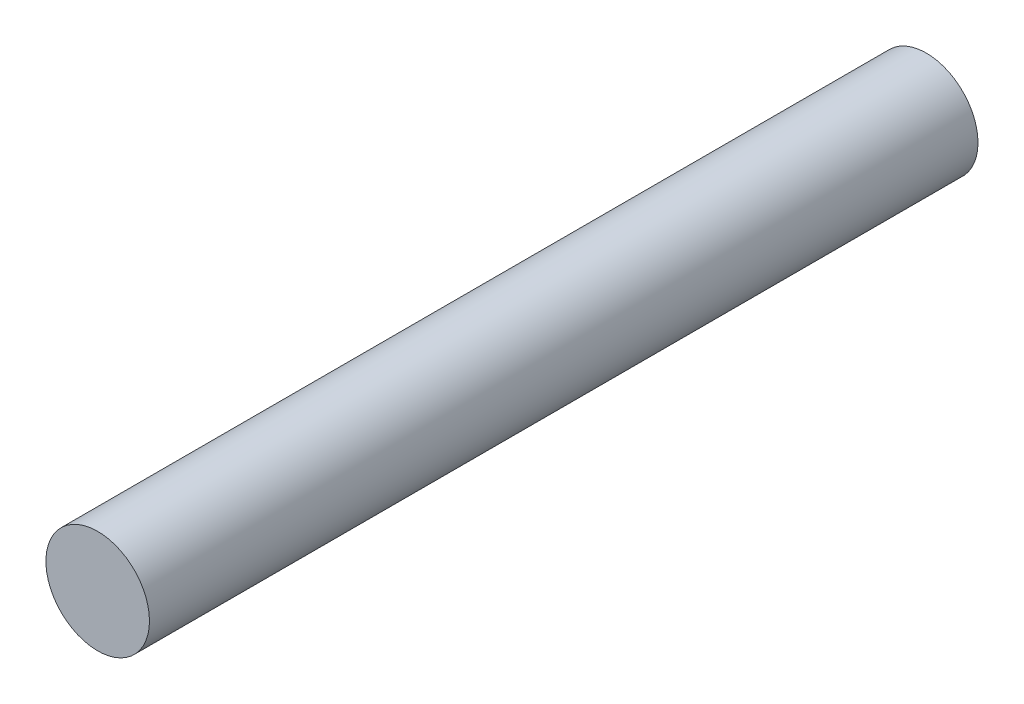
ISO-10303-21;
HEADER;
FILE_DESCRIPTION(('STEP AP214'),'2;1');
FILE_NAME('part.step','',(''),(''),'','','');
FILE_SCHEMA(('AUTOMOTIVE_DESIGN { 1 0 10303 214 1 1 1 1 }'));
ENDSEC;
DATA;
#1=APPLICATION_CONTEXT('core data for automotive mechanical design processes');
#2=APPLICATION_PROTOCOL_DEFINITION('international standard','automotive_design',2000,#1);
#3=PRODUCT_CONTEXT('',#1,'mechanical');
#4=PRODUCT('Part','Part','',(#3));
#5=PRODUCT_RELATED_PRODUCT_CATEGORY('part','',(#4));
#6=PRODUCT_DEFINITION_FORMATION('','',#4);
#7=PRODUCT_DEFINITION_CONTEXT('part definition',#1,'design');
#8=PRODUCT_DEFINITION('design','',#6,#7);
#9=PRODUCT_DEFINITION_SHAPE('','',#8);
#10=(LENGTH_UNIT() NAMED_UNIT(*) SI_UNIT(.MILLI.,.METRE.));
#11=(NAMED_UNIT(*) PLANE_ANGLE_UNIT() SI_UNIT($,.RADIAN.));
#12=(NAMED_UNIT(*) SI_UNIT($,.STERADIAN.) SOLID_ANGLE_UNIT());
#13=UNCERTAINTY_MEASURE_WITH_UNIT(LENGTH_MEASURE(1.E-05),#10,'distance_accuracy_value','');
#14=(GEOMETRIC_REPRESENTATION_CONTEXT(3) GLOBAL_UNCERTAINTY_ASSIGNED_CONTEXT((#13)) GLOBAL_UNIT_ASSIGNED_CONTEXT((#10,
#11,#12)) REPRESENTATION_CONTEXT('',''));
#15=CARTESIAN_POINT('',(0.,0.,0.));
#16=DIRECTION('',(0.,0.,1.));
#17=DIRECTION('',(1.,0.,0.));
#18=AXIS2_PLACEMENT_3D('',#15,#16,#17);
#19=CARTESIAN_POINT('',(0.,0.,101.6));
#20=DIRECTION('',(0.,0.,-1.));
#21=DIRECTION('',(-1.,0.,0.));
#22=AXIS2_PLACEMENT_3D('',#19,#20,#21);
#23=CYLINDRICAL_SURFACE('',#22,6.35);
#24=CARTESIAN_POINT('',(0.,0.,101.6));
#25=DIRECTION('',(0.,0.,1.));
#26=DIRECTION('',(1.,0.,0.));
#27=AXIS2_PLACEMENT_3D('',#24,#25,#26);
#28=CIRCLE('',#27,6.35);
#29=CARTESIAN_POINT('',(6.35,0.,101.6));
#30=VERTEX_POINT('',#29);
#31=EDGE_CURVE('E10',#30,#30,#28,.T.);
#32=ORIENTED_EDGE('',*,*,#31,.F.);
#33=EDGE_LOOP('',(#32));
#34=FACE_BOUND('',#33,.T.);
#35=CARTESIAN_POINT('',(0.,0.,0.));
#36=DIRECTION('',(0.,0.,1.));
#37=DIRECTION('',(1.,0.,0.));
#38=AXIS2_PLACEMENT_3D('',#35,#36,#37);
#39=CIRCLE('',#38,6.35);
#40=CARTESIAN_POINT('',(6.35,0.,0.));
#41=VERTEX_POINT('',#40);
#42=EDGE_CURVE('E35',#41,#41,#39,.T.);
#43=ORIENTED_EDGE('',*,*,#42,.T.);
#44=EDGE_LOOP('',(#43));
#45=FACE_BOUND('',#44,.T.);
#46=ADVANCED_FACE('F32',(#34,#45),#23,.T.);
#47=CARTESIAN_POINT('',(0.,0.,101.6));
#48=DIRECTION('',(0.,0.,1.));
#49=DIRECTION('',(1.,0.,0.));
#50=AXIS2_PLACEMENT_3D('',#47,#48,#49);
#51=PLANE('',#50);
#52=ORIENTED_EDGE('',*,*,#31,.T.);
#53=EDGE_LOOP('',(#52));
#54=FACE_BOUND('',#53,.T.);
#55=ADVANCED_FACE('F47',(#54),#51,.T.);
#56=CARTESIAN_POINT('',(0.,0.,0.));
#57=DIRECTION('',(0.,0.,1.));
#58=DIRECTION('',(1.,0.,0.));
#59=AXIS2_PLACEMENT_3D('',#56,#57,#58);
#60=PLANE('',#59);
#61=ORIENTED_EDGE('',*,*,#42,.F.);
#62=EDGE_LOOP('',(#61));
#63=FACE_BOUND('',#62,.T.);
#64=ADVANCED_FACE('F45',(#63),#60,.F.);
#65=CLOSED_SHELL('',(#46,#55,#64));
#66=MANIFOLD_SOLID_BREP('B2',#65);
#67=ADVANCED_BREP_SHAPE_REPRESENTATION('',(#18,#66),#14);
#68=SHAPE_DEFINITION_REPRESENTATION(#9,#67);
ENDSEC;
END-ISO-10303-21;
